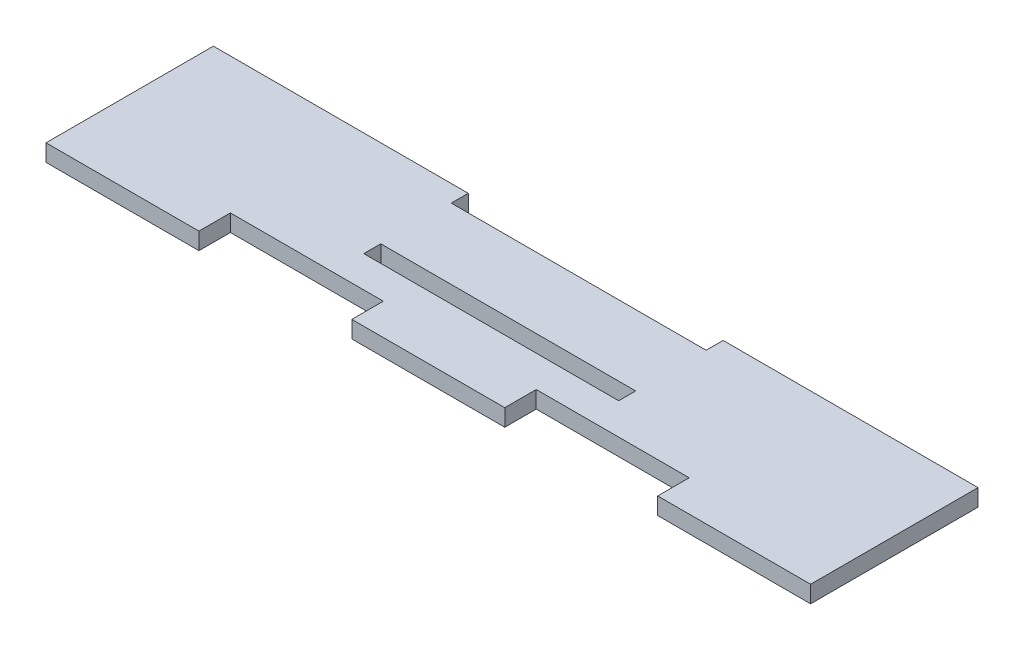
ISO-10303-21;
HEADER;
FILE_DESCRIPTION(('STEP AP214'),'2;1');
FILE_NAME('part.step','',(''),(''),'','','');
FILE_SCHEMA(('AUTOMOTIVE_DESIGN { 1 0 10303 214 1 1 1 1 }'));
ENDSEC;
DATA;
#1=APPLICATION_CONTEXT('core data for automotive mechanical design processes');
#2=APPLICATION_PROTOCOL_DEFINITION('international standard','automotive_design',2000,#1);
#3=PRODUCT_CONTEXT('',#1,'mechanical');
#4=PRODUCT('Part','Part','',(#3));
#5=PRODUCT_RELATED_PRODUCT_CATEGORY('part','',(#4));
#6=PRODUCT_DEFINITION_FORMATION('','',#4);
#7=PRODUCT_DEFINITION_CONTEXT('part definition',#1,'design');
#8=PRODUCT_DEFINITION('design','',#6,#7);
#9=PRODUCT_DEFINITION_SHAPE('','',#8);
#10=(LENGTH_UNIT() NAMED_UNIT(*) SI_UNIT(.MILLI.,.METRE.));
#11=(NAMED_UNIT(*) PLANE_ANGLE_UNIT() SI_UNIT($,.RADIAN.));
#12=(NAMED_UNIT(*) SI_UNIT($,.STERADIAN.) SOLID_ANGLE_UNIT());
#13=UNCERTAINTY_MEASURE_WITH_UNIT(LENGTH_MEASURE(1.E-05),#10,'distance_accuracy_value','');
#14=(GEOMETRIC_REPRESENTATION_CONTEXT(3) GLOBAL_UNCERTAINTY_ASSIGNED_CONTEXT((#13)) GLOBAL_UNIT_ASSIGNED_CONTEXT((#10,
#11,#12)) REPRESENTATION_CONTEXT('',''));
#15=CARTESIAN_POINT('',(0.,0.,0.));
#16=DIRECTION('',(0.,0.,1.));
#17=DIRECTION('',(1.,0.,0.));
#18=AXIS2_PLACEMENT_3D('',#15,#16,#17);
#19=CARTESIAN_POINT('',(0.,2.7,0.));
#20=DIRECTION('',(0.,-1.,0.));
#21=DIRECTION('',(0.,0.,-1.));
#22=AXIS2_PLACEMENT_3D('',#19,#20,#21);
#23=PLANE('',#22);
#24=DIRECTION('',(1.,0.,0.));
#25=VECTOR('',#24,1.);
#26=CARTESIAN_POINT('',(36.45,2.7,13.3));
#27=LINE('',#26,#25);
#28=CARTESIAN_POINT('',(36.45,2.7,13.3));
#29=VERTEX_POINT('',#28);
#30=CARTESIAN_POINT('',(60.75,2.7,13.3));
#31=VERTEX_POINT('',#30);
#32=EDGE_CURVE('E206',#29,#31,#27,.T.);
#33=ORIENTED_EDGE('',*,*,#32,.T.);
#34=DIRECTION('',(0.,0.,-1.));
#35=VECTOR('',#34,1.);
#36=CARTESIAN_POINT('',(60.75,2.7,-13.3));
#37=LINE('',#36,#35);
#38=CARTESIAN_POINT('',(60.75,2.7,-13.3));
#39=VERTEX_POINT('',#38);
#40=EDGE_CURVE('E209',#31,#39,#37,.T.);
#41=ORIENTED_EDGE('',*,*,#40,.T.);
#42=DIRECTION('',(-1.,0.,0.));
#43=VECTOR('',#42,1.);
#44=CARTESIAN_POINT('',(20.25,2.7,-13.3));
#45=LINE('',#44,#43);
#46=CARTESIAN_POINT('',(20.25,2.7,-13.3));
#47=VERTEX_POINT('',#46);
#48=EDGE_CURVE('E212',#39,#47,#45,.T.);
#49=ORIENTED_EDGE('',*,*,#48,.T.);
#50=DIRECTION('',(0.,0.,1.));
#51=VECTOR('',#50,1.);
#52=CARTESIAN_POINT('',(20.25,2.7,-13.3));
#53=LINE('',#52,#51);
#54=CARTESIAN_POINT('',(20.25,2.7,-10.6));
#55=VERTEX_POINT('',#54);
#56=EDGE_CURVE('E214',#47,#55,#53,.T.);
#57=ORIENTED_EDGE('',*,*,#56,.T.);
#58=DIRECTION('',(-1.,0.,0.));
#59=VECTOR('',#58,1.);
#60=CARTESIAN_POINT('',(-20.25,2.7,-10.6));
#61=LINE('',#60,#59);
#62=CARTESIAN_POINT('',(-20.25,2.7,-10.6));
#63=VERTEX_POINT('',#62);
#64=EDGE_CURVE('E216',#55,#63,#61,.T.);
#65=ORIENTED_EDGE('',*,*,#64,.T.);
#66=DIRECTION('',(0.,0.,-1.));
#67=VECTOR('',#66,1.);
#68=CARTESIAN_POINT('',(-20.25,2.7,-13.3));
#69=LINE('',#68,#67);
#70=CARTESIAN_POINT('',(-20.25,2.7,-13.3));
#71=VERTEX_POINT('',#70);
#72=EDGE_CURVE('E218',#63,#71,#69,.T.);
#73=ORIENTED_EDGE('',*,*,#72,.T.);
#74=DIRECTION('',(-1.,0.,0.));
#75=VECTOR('',#74,1.);
#76=CARTESIAN_POINT('',(-60.75,2.7,-13.3));
#77=LINE('',#76,#75);
#78=CARTESIAN_POINT('',(-60.75,2.7,-13.3));
#79=VERTEX_POINT('',#78);
#80=EDGE_CURVE('E220',#71,#79,#77,.T.);
#81=ORIENTED_EDGE('',*,*,#80,.T.);
#82=DIRECTION('',(0.,0.,1.));
#83=VECTOR('',#82,1.);
#84=CARTESIAN_POINT('',(-60.75,2.7,-13.3));
#85=LINE('',#84,#83);
#86=CARTESIAN_POINT('',(-60.75,2.7,13.3));
#87=VERTEX_POINT('',#86);
#88=EDGE_CURVE('E222',#79,#87,#85,.T.);
#89=ORIENTED_EDGE('',*,*,#88,.T.);
#90=DIRECTION('',(1.,0.,0.));
#91=VECTOR('',#90,1.);
#92=CARTESIAN_POINT('',(-60.75,2.7,13.3));
#93=LINE('',#92,#91);
#94=CARTESIAN_POINT('',(-36.45,2.7,13.3));
#95=VERTEX_POINT('',#94);
#96=EDGE_CURVE('E224',#87,#95,#93,.T.);
#97=ORIENTED_EDGE('',*,*,#96,.T.);
#98=DIRECTION('',(0.,0.,-1.));
#99=VECTOR('',#98,1.);
#100=CARTESIAN_POINT('',(-36.45,2.7,13.3));
#101=LINE('',#100,#99);
#102=CARTESIAN_POINT('',(-36.45,2.7,8.3));
#103=VERTEX_POINT('',#102);
#104=EDGE_CURVE('E226',#95,#103,#101,.T.);
#105=ORIENTED_EDGE('',*,*,#104,.T.);
#106=DIRECTION('',(1.,0.,0.));
#107=VECTOR('',#106,1.);
#108=CARTESIAN_POINT('',(-36.45,2.7,8.3));
#109=LINE('',#108,#107);
#110=CARTESIAN_POINT('',(-12.15,2.7,8.3));
#111=VERTEX_POINT('',#110);
#112=EDGE_CURVE('E228',#103,#111,#109,.T.);
#113=ORIENTED_EDGE('',*,*,#112,.T.);
#114=DIRECTION('',(0.,0.,1.));
#115=VECTOR('',#114,1.);
#116=CARTESIAN_POINT('',(-12.15,2.7,13.3));
#117=LINE('',#116,#115);
#118=CARTESIAN_POINT('',(-12.15,2.7,13.3));
#119=VERTEX_POINT('',#118);
#120=EDGE_CURVE('E230',#111,#119,#117,.T.);
#121=ORIENTED_EDGE('',*,*,#120,.T.);
#122=DIRECTION('',(1.,0.,0.));
#123=VECTOR('',#122,1.);
#124=CARTESIAN_POINT('',(-12.15,2.7,13.3));
#125=LINE('',#124,#123);
#126=CARTESIAN_POINT('',(12.15,2.7,13.3));
#127=VERTEX_POINT('',#126);
#128=EDGE_CURVE('E232',#119,#127,#125,.T.);
#129=ORIENTED_EDGE('',*,*,#128,.T.);
#130=DIRECTION('',(0.,0.,-1.));
#131=VECTOR('',#130,1.);
#132=CARTESIAN_POINT('',(12.15,2.7,13.3));
#133=LINE('',#132,#131);
#134=CARTESIAN_POINT('',(12.15,2.7,8.3));
#135=VERTEX_POINT('',#134);
#136=EDGE_CURVE('E234',#127,#135,#133,.T.);
#137=ORIENTED_EDGE('',*,*,#136,.T.);
#138=DIRECTION('',(1.,0.,0.));
#139=VECTOR('',#138,1.);
#140=CARTESIAN_POINT('',(12.15,2.7,8.3));
#141=LINE('',#140,#139);
#142=CARTESIAN_POINT('',(36.45,2.7,8.3));
#143=VERTEX_POINT('',#142);
#144=EDGE_CURVE('E236',#135,#143,#141,.T.);
#145=ORIENTED_EDGE('',*,*,#144,.T.);
#146=DIRECTION('',(0.,0.,1.));
#147=VECTOR('',#146,1.);
#148=CARTESIAN_POINT('',(36.45,2.7,13.3));
#149=LINE('',#148,#147);
#150=EDGE_CURVE('E238',#143,#29,#149,.T.);
#151=ORIENTED_EDGE('',*,*,#150,.T.);
#152=EDGE_LOOP('',(#33,#41,#49,#57,#65,#73,#81,#89,#97,#105,#113,#121,#129,#137,#145,#151));
#153=FACE_BOUND('',#152,.T.);
#154=DIRECTION('',(0.,0.,1.));
#155=VECTOR('',#154,1.);
#156=CARTESIAN_POINT('',(-20.25,2.7,0.600000000000001));
#157=LINE('',#156,#155);
#158=CARTESIAN_POINT('',(-20.25,2.7,0.600000000000001));
#159=VERTEX_POINT('',#158);
#160=CARTESIAN_POINT('',(-20.25,2.7,3.3));
#161=VERTEX_POINT('',#160);
#162=EDGE_CURVE('E170',#159,#161,#157,.T.);
#163=ORIENTED_EDGE('',*,*,#162,.F.);
#164=DIRECTION('',(-1.,0.,0.));
#165=VECTOR('',#164,1.);
#166=CARTESIAN_POINT('',(-20.25,2.7,0.600000000000001));
#167=LINE('',#166,#165);
#168=CARTESIAN_POINT('',(20.25,2.7,0.600000000000001));
#169=VERTEX_POINT('',#168);
#170=EDGE_CURVE('E192',#169,#159,#167,.T.);
#171=ORIENTED_EDGE('',*,*,#170,.F.);
#172=DIRECTION('',(0.,0.,-1.));
#173=VECTOR('',#172,1.);
#174=CARTESIAN_POINT('',(20.25,2.7,0.600000000000001));
#175=LINE('',#174,#173);
#176=CARTESIAN_POINT('',(20.25,2.7,3.3));
#177=VERTEX_POINT('',#176);
#178=EDGE_CURVE('E190',#177,#169,#175,.T.);
#179=ORIENTED_EDGE('',*,*,#178,.F.);
#180=DIRECTION('',(1.,0.,0.));
#181=VECTOR('',#180,1.);
#182=CARTESIAN_POINT('',(-20.25,2.7,3.3));
#183=LINE('',#182,#181);
#184=EDGE_CURVE('E178',#161,#177,#183,.T.);
#185=ORIENTED_EDGE('',*,*,#184,.F.);
#186=EDGE_LOOP('',(#163,#171,#179,#185));
#187=FACE_BOUND('',#186,.T.);
#188=ADVANCED_FACE('F33',(#153,#187),#23,.F.);
#189=CARTESIAN_POINT('',(0.,0.,0.));
#190=DIRECTION('',(0.,-1.,0.));
#191=DIRECTION('',(0.,0.,-1.));
#192=AXIS2_PLACEMENT_3D('',#189,#190,#191);
#193=PLANE('',#192);
#194=DIRECTION('',(1.,0.,0.));
#195=VECTOR('',#194,1.);
#196=CARTESIAN_POINT('',(36.45,0.,13.3));
#197=LINE('',#196,#195);
#198=CARTESIAN_POINT('',(36.45,0.,13.3));
#199=VERTEX_POINT('',#198);
#200=CARTESIAN_POINT('',(60.75,0.,13.3));
#201=VERTEX_POINT('',#200);
#202=EDGE_CURVE('E186',#199,#201,#197,.T.);
#203=ORIENTED_EDGE('',*,*,#202,.F.);
#204=DIRECTION('',(0.,0.,1.));
#205=VECTOR('',#204,1.);
#206=CARTESIAN_POINT('',(36.45,0.,13.3));
#207=LINE('',#206,#205);
#208=CARTESIAN_POINT('',(36.45,0.,8.3));
#209=VERTEX_POINT('',#208);
#210=EDGE_CURVE('E210',#209,#199,#207,.T.);
#211=ORIENTED_EDGE('',*,*,#210,.F.);
#212=DIRECTION('',(1.,0.,0.));
#213=VECTOR('',#212,1.);
#214=CARTESIAN_POINT('',(12.15,0.,8.3));
#215=LINE('',#214,#213);
#216=CARTESIAN_POINT('',(12.15,0.,8.3));
#217=VERTEX_POINT('',#216);
#218=EDGE_CURVE('E269',#217,#209,#215,.T.);
#219=ORIENTED_EDGE('',*,*,#218,.F.);
#220=DIRECTION('',(0.,0.,-1.));
#221=VECTOR('',#220,1.);
#222=CARTESIAN_POINT('',(12.15,0.,13.3));
#223=LINE('',#222,#221);
#224=CARTESIAN_POINT('',(12.15,0.,13.3));
#225=VERTEX_POINT('',#224);
#226=EDGE_CURVE('E267',#225,#217,#223,.T.);
#227=ORIENTED_EDGE('',*,*,#226,.F.);
#228=DIRECTION('',(1.,0.,0.));
#229=VECTOR('',#228,1.);
#230=CARTESIAN_POINT('',(-12.15,0.,13.3));
#231=LINE('',#230,#229);
#232=CARTESIAN_POINT('',(-12.15,0.,13.3));
#233=VERTEX_POINT('',#232);
#234=EDGE_CURVE('E265',#233,#225,#231,.T.);
#235=ORIENTED_EDGE('',*,*,#234,.F.);
#236=DIRECTION('',(0.,0.,1.));
#237=VECTOR('',#236,1.);
#238=CARTESIAN_POINT('',(-12.15,0.,13.3));
#239=LINE('',#238,#237);
#240=CARTESIAN_POINT('',(-12.15,0.,8.3));
#241=VERTEX_POINT('',#240);
#242=EDGE_CURVE('E263',#241,#233,#239,.T.);
#243=ORIENTED_EDGE('',*,*,#242,.F.);
#244=DIRECTION('',(1.,0.,0.));
#245=VECTOR('',#244,1.);
#246=CARTESIAN_POINT('',(-36.45,0.,8.3));
#247=LINE('',#246,#245);
#248=CARTESIAN_POINT('',(-36.45,0.,8.3));
#249=VERTEX_POINT('',#248);
#250=EDGE_CURVE('E261',#249,#241,#247,.T.);
#251=ORIENTED_EDGE('',*,*,#250,.F.);
#252=DIRECTION('',(0.,0.,-1.));
#253=VECTOR('',#252,1.);
#254=CARTESIAN_POINT('',(-36.45,0.,13.3));
#255=LINE('',#254,#253);
#256=CARTESIAN_POINT('',(-36.45,0.,13.3));
#257=VERTEX_POINT('',#256);
#258=EDGE_CURVE('E259',#257,#249,#255,.T.);
#259=ORIENTED_EDGE('',*,*,#258,.F.);
#260=DIRECTION('',(1.,0.,0.));
#261=VECTOR('',#260,1.);
#262=CARTESIAN_POINT('',(-60.75,0.,13.3));
#263=LINE('',#262,#261);
#264=CARTESIAN_POINT('',(-60.75,0.,13.3));
#265=VERTEX_POINT('',#264);
#266=EDGE_CURVE('E257',#265,#257,#263,.T.);
#267=ORIENTED_EDGE('',*,*,#266,.F.);
#268=DIRECTION('',(0.,0.,1.));
#269=VECTOR('',#268,1.);
#270=CARTESIAN_POINT('',(-60.75,0.,-13.3));
#271=LINE('',#270,#269);
#272=CARTESIAN_POINT('',(-60.75,0.,-13.3));
#273=VERTEX_POINT('',#272);
#274=EDGE_CURVE('E255',#273,#265,#271,.T.);
#275=ORIENTED_EDGE('',*,*,#274,.F.);
#276=DIRECTION('',(-1.,0.,0.));
#277=VECTOR('',#276,1.);
#278=CARTESIAN_POINT('',(-60.75,0.,-13.3));
#279=LINE('',#278,#277);
#280=CARTESIAN_POINT('',(-20.25,0.,-13.3));
#281=VERTEX_POINT('',#280);
#282=EDGE_CURVE('E253',#281,#273,#279,.T.);
#283=ORIENTED_EDGE('',*,*,#282,.F.);
#284=DIRECTION('',(0.,0.,-1.));
#285=VECTOR('',#284,1.);
#286=CARTESIAN_POINT('',(-20.25,0.,-13.3));
#287=LINE('',#286,#285);
#288=CARTESIAN_POINT('',(-20.25,0.,-10.6));
#289=VERTEX_POINT('',#288);
#290=EDGE_CURVE('E251',#289,#281,#287,.T.);
#291=ORIENTED_EDGE('',*,*,#290,.F.);
#292=DIRECTION('',(-1.,0.,0.));
#293=VECTOR('',#292,1.);
#294=CARTESIAN_POINT('',(-20.25,0.,-10.6));
#295=LINE('',#294,#293);
#296=CARTESIAN_POINT('',(20.25,0.,-10.6));
#297=VERTEX_POINT('',#296);
#298=EDGE_CURVE('E249',#297,#289,#295,.T.);
#299=ORIENTED_EDGE('',*,*,#298,.F.);
#300=DIRECTION('',(0.,0.,1.));
#301=VECTOR('',#300,1.);
#302=CARTESIAN_POINT('',(20.25,0.,-13.3));
#303=LINE('',#302,#301);
#304=CARTESIAN_POINT('',(20.25,0.,-13.3));
#305=VERTEX_POINT('',#304);
#306=EDGE_CURVE('E247',#305,#297,#303,.T.);
#307=ORIENTED_EDGE('',*,*,#306,.F.);
#308=DIRECTION('',(-1.,0.,0.));
#309=VECTOR('',#308,1.);
#310=CARTESIAN_POINT('',(20.25,0.,-13.3));
#311=LINE('',#310,#309);
#312=CARTESIAN_POINT('',(60.75,0.,-13.3));
#313=VERTEX_POINT('',#312);
#314=EDGE_CURVE('E245',#313,#305,#311,.T.);
#315=ORIENTED_EDGE('',*,*,#314,.F.);
#316=DIRECTION('',(0.,0.,-1.));
#317=VECTOR('',#316,1.);
#318=CARTESIAN_POINT('',(60.75,0.,-13.3));
#319=LINE('',#318,#317);
#320=EDGE_CURVE('E243',#201,#313,#319,.T.);
#321=ORIENTED_EDGE('',*,*,#320,.F.);
#322=EDGE_LOOP('',(#203,#211,#219,#227,#235,#243,#251,#259,#267,#275,#283,#291,#299,#307,#315,#321));
#323=FACE_BOUND('',#322,.T.);
#324=DIRECTION('',(-1.,0.,0.));
#325=VECTOR('',#324,1.);
#326=CARTESIAN_POINT('',(-20.25,0.,0.600000000000001));
#327=LINE('',#326,#325);
#328=CARTESIAN_POINT('',(20.25,0.,0.600000000000001));
#329=VERTEX_POINT('',#328);
#330=CARTESIAN_POINT('',(-20.25,0.,0.600000000000001));
#331=VERTEX_POINT('',#330);
#332=EDGE_CURVE('E179',#329,#331,#327,.T.);
#333=ORIENTED_EDGE('',*,*,#332,.T.);
#334=DIRECTION('',(0.,0.,1.));
#335=VECTOR('',#334,1.);
#336=CARTESIAN_POINT('',(-20.25,0.,0.600000000000001));
#337=LINE('',#336,#335);
#338=CARTESIAN_POINT('',(-20.25,0.,3.3));
#339=VERTEX_POINT('',#338);
#340=EDGE_CURVE('E56',#331,#339,#337,.T.);
#341=ORIENTED_EDGE('',*,*,#340,.T.);
#342=DIRECTION('',(1.,0.,0.));
#343=VECTOR('',#342,1.);
#344=CARTESIAN_POINT('',(-20.25,0.,3.3));
#345=LINE('',#344,#343);
#346=CARTESIAN_POINT('',(20.25,0.,3.3));
#347=VERTEX_POINT('',#346);
#348=EDGE_CURVE('E185',#339,#347,#345,.T.);
#349=ORIENTED_EDGE('',*,*,#348,.T.);
#350=DIRECTION('',(0.,0.,-1.));
#351=VECTOR('',#350,1.);
#352=CARTESIAN_POINT('',(20.25,0.,0.600000000000001));
#353=LINE('',#352,#351);
#354=EDGE_CURVE('E198',#347,#329,#353,.T.);
#355=ORIENTED_EDGE('',*,*,#354,.T.);
#356=EDGE_LOOP('',(#333,#341,#349,#355));
#357=FACE_BOUND('',#356,.T.);
#358=ADVANCED_FACE('F323',(#323,#357),#193,.T.);
#359=CARTESIAN_POINT('',(36.45,2.7,13.3));
#360=DIRECTION('',(0.,0.,-1.));
#361=DIRECTION('',(-1.,0.,0.));
#362=AXIS2_PLACEMENT_3D('',#359,#360,#361);
#363=PLANE('',#362);
#364=ORIENTED_EDGE('',*,*,#202,.T.);
#365=DIRECTION('',(0.,-1.,0.));
#366=VECTOR('',#365,1.);
#367=CARTESIAN_POINT('',(60.75,2.7,13.3));
#368=LINE('',#367,#366);
#369=EDGE_CURVE('E11',#31,#201,#368,.T.);
#370=ORIENTED_EDGE('',*,*,#369,.F.);
#371=ORIENTED_EDGE('',*,*,#32,.F.);
#372=DIRECTION('',(0.,-1.,0.));
#373=VECTOR('',#372,1.);
#374=CARTESIAN_POINT('',(36.45,2.7,13.3));
#375=LINE('',#374,#373);
#376=EDGE_CURVE('E240',#29,#199,#375,.T.);
#377=ORIENTED_EDGE('',*,*,#376,.T.);
#378=EDGE_LOOP('',(#364,#370,#371,#377));
#379=FACE_BOUND('',#378,.T.);
#380=ADVANCED_FACE('F35',(#379),#363,.F.);
#381=CARTESIAN_POINT('',(60.75,2.7,-13.3));
#382=DIRECTION('',(-1.,0.,0.));
#383=DIRECTION('',(0.,0.,1.));
#384=AXIS2_PLACEMENT_3D('',#381,#382,#383);
#385=PLANE('',#384);
#386=ORIENTED_EDGE('',*,*,#320,.T.);
#387=DIRECTION('',(0.,-1.,0.));
#388=VECTOR('',#387,1.);
#389=CARTESIAN_POINT('',(60.75,2.7,-13.3));
#390=LINE('',#389,#388);
#391=EDGE_CURVE('E41',#39,#313,#390,.T.);
#392=ORIENTED_EDGE('',*,*,#391,.F.);
#393=ORIENTED_EDGE('',*,*,#40,.F.);
#394=ORIENTED_EDGE('',*,*,#369,.T.);
#395=EDGE_LOOP('',(#386,#392,#393,#394));
#396=FACE_BOUND('',#395,.T.);
#397=ADVANCED_FACE('F340',(#396),#385,.F.);
#398=CARTESIAN_POINT('',(20.25,2.7,-13.3));
#399=DIRECTION('',(0.,0.,1.));
#400=DIRECTION('',(1.,0.,0.));
#401=AXIS2_PLACEMENT_3D('',#398,#399,#400);
#402=PLANE('',#401);
#403=ORIENTED_EDGE('',*,*,#314,.T.);
#404=DIRECTION('',(0.,-1.,0.));
#405=VECTOR('',#404,1.);
#406=CARTESIAN_POINT('',(20.25,2.7,-13.3));
#407=LINE('',#406,#405);
#408=EDGE_CURVE('E310',#47,#305,#407,.T.);
#409=ORIENTED_EDGE('',*,*,#408,.F.);
#410=ORIENTED_EDGE('',*,*,#48,.F.);
#411=ORIENTED_EDGE('',*,*,#391,.T.);
#412=EDGE_LOOP('',(#403,#409,#410,#411));
#413=FACE_BOUND('',#412,.T.);
#414=ADVANCED_FACE('F317',(#413),#402,.F.);
#415=CARTESIAN_POINT('',(20.25,2.7,-13.3));
#416=DIRECTION('',(1.,0.,0.));
#417=DIRECTION('',(0.,0.,-1.));
#418=AXIS2_PLACEMENT_3D('',#415,#416,#417);
#419=PLANE('',#418);
#420=ORIENTED_EDGE('',*,*,#306,.T.);
#421=DIRECTION('',(0.,-1.,0.));
#422=VECTOR('',#421,1.);
#423=CARTESIAN_POINT('',(20.25,2.7,-10.6));
#424=LINE('',#423,#422);
#425=EDGE_CURVE('E307',#55,#297,#424,.T.);
#426=ORIENTED_EDGE('',*,*,#425,.F.);
#427=ORIENTED_EDGE('',*,*,#56,.F.);
#428=ORIENTED_EDGE('',*,*,#408,.T.);
#429=EDGE_LOOP('',(#420,#426,#427,#428));
#430=FACE_BOUND('',#429,.T.);
#431=ADVANCED_FACE('F329',(#430),#419,.F.);
#432=CARTESIAN_POINT('',(-20.25,2.7,-10.6));
#433=DIRECTION('',(0.,0.,1.));
#434=DIRECTION('',(1.,0.,0.));
#435=AXIS2_PLACEMENT_3D('',#432,#433,#434);
#436=PLANE('',#435);
#437=ORIENTED_EDGE('',*,*,#298,.T.);
#438=DIRECTION('',(0.,-1.,0.));
#439=VECTOR('',#438,1.);
#440=CARTESIAN_POINT('',(-20.25,2.7,-10.6));
#441=LINE('',#440,#439);
#442=EDGE_CURVE('E304',#63,#289,#441,.T.);
#443=ORIENTED_EDGE('',*,*,#442,.F.);
#444=ORIENTED_EDGE('',*,*,#64,.F.);
#445=ORIENTED_EDGE('',*,*,#425,.T.);
#446=EDGE_LOOP('',(#437,#443,#444,#445));
#447=FACE_BOUND('',#446,.T.);
#448=ADVANCED_FACE('F333',(#447),#436,.F.);
#449=CARTESIAN_POINT('',(-20.25,2.7,-13.3));
#450=DIRECTION('',(-1.,0.,0.));
#451=DIRECTION('',(0.,0.,1.));
#452=AXIS2_PLACEMENT_3D('',#449,#450,#451);
#453=PLANE('',#452);
#454=ORIENTED_EDGE('',*,*,#290,.T.);
#455=DIRECTION('',(0.,-1.,0.));
#456=VECTOR('',#455,1.);
#457=CARTESIAN_POINT('',(-20.25,2.7,-13.3));
#458=LINE('',#457,#456);
#459=EDGE_CURVE('E301',#71,#281,#458,.T.);
#460=ORIENTED_EDGE('',*,*,#459,.F.);
#461=ORIENTED_EDGE('',*,*,#72,.F.);
#462=ORIENTED_EDGE('',*,*,#442,.T.);
#463=EDGE_LOOP('',(#454,#460,#461,#462));
#464=FACE_BOUND('',#463,.T.);
#465=ADVANCED_FACE('F393',(#464),#453,.F.);
#466=CARTESIAN_POINT('',(-60.75,2.7,-13.3));
#467=DIRECTION('',(0.,0.,1.));
#468=DIRECTION('',(1.,0.,0.));
#469=AXIS2_PLACEMENT_3D('',#466,#467,#468);
#470=PLANE('',#469);
#471=ORIENTED_EDGE('',*,*,#282,.T.);
#472=DIRECTION('',(0.,-1.,0.));
#473=VECTOR('',#472,1.);
#474=CARTESIAN_POINT('',(-60.75,2.7,-13.3));
#475=LINE('',#474,#473);
#476=EDGE_CURVE('E298',#79,#273,#475,.T.);
#477=ORIENTED_EDGE('',*,*,#476,.F.);
#478=ORIENTED_EDGE('',*,*,#80,.F.);
#479=ORIENTED_EDGE('',*,*,#459,.T.);
#480=EDGE_LOOP('',(#471,#477,#478,#479));
#481=FACE_BOUND('',#480,.T.);
#482=ADVANCED_FACE('F390',(#481),#470,.F.);
#483=CARTESIAN_POINT('',(-60.75,2.7,-13.3));
#484=DIRECTION('',(1.,0.,0.));
#485=DIRECTION('',(0.,0.,-1.));
#486=AXIS2_PLACEMENT_3D('',#483,#484,#485);
#487=PLANE('',#486);
#488=ORIENTED_EDGE('',*,*,#274,.T.);
#489=DIRECTION('',(0.,-1.,0.));
#490=VECTOR('',#489,1.);
#491=CARTESIAN_POINT('',(-60.75,2.7,13.3));
#492=LINE('',#491,#490);
#493=EDGE_CURVE('E295',#87,#265,#492,.T.);
#494=ORIENTED_EDGE('',*,*,#493,.F.);
#495=ORIENTED_EDGE('',*,*,#88,.F.);
#496=ORIENTED_EDGE('',*,*,#476,.T.);
#497=EDGE_LOOP('',(#488,#494,#495,#496));
#498=FACE_BOUND('',#497,.T.);
#499=ADVANCED_FACE('F386',(#498),#487,.F.);
#500=CARTESIAN_POINT('',(-60.75,2.7,13.3));
#501=DIRECTION('',(0.,0.,-1.));
#502=DIRECTION('',(-1.,0.,0.));
#503=AXIS2_PLACEMENT_3D('',#500,#501,#502);
#504=PLANE('',#503);
#505=ORIENTED_EDGE('',*,*,#266,.T.);
#506=DIRECTION('',(0.,-1.,0.));
#507=VECTOR('',#506,1.);
#508=CARTESIAN_POINT('',(-36.45,2.7,13.3));
#509=LINE('',#508,#507);
#510=EDGE_CURVE('E292',#95,#257,#509,.T.);
#511=ORIENTED_EDGE('',*,*,#510,.F.);
#512=ORIENTED_EDGE('',*,*,#96,.F.);
#513=ORIENTED_EDGE('',*,*,#493,.T.);
#514=EDGE_LOOP('',(#505,#511,#512,#513));
#515=FACE_BOUND('',#514,.T.);
#516=ADVANCED_FACE('F382',(#515),#504,.F.);
#517=CARTESIAN_POINT('',(-36.45,2.7,13.3));
#518=DIRECTION('',(-1.,0.,0.));
#519=DIRECTION('',(0.,0.,1.));
#520=AXIS2_PLACEMENT_3D('',#517,#518,#519);
#521=PLANE('',#520);
#522=ORIENTED_EDGE('',*,*,#258,.T.);
#523=DIRECTION('',(0.,-1.,0.));
#524=VECTOR('',#523,1.);
#525=CARTESIAN_POINT('',(-36.45,2.7,8.3));
#526=LINE('',#525,#524);
#527=EDGE_CURVE('E289',#103,#249,#526,.T.);
#528=ORIENTED_EDGE('',*,*,#527,.F.);
#529=ORIENTED_EDGE('',*,*,#104,.F.);
#530=ORIENTED_EDGE('',*,*,#510,.T.);
#531=EDGE_LOOP('',(#522,#528,#529,#530));
#532=FACE_BOUND('',#531,.T.);
#533=ADVANCED_FACE('F377',(#532),#521,.F.);
#534=CARTESIAN_POINT('',(-36.45,2.7,8.3));
#535=DIRECTION('',(0.,0.,-1.));
#536=DIRECTION('',(-1.,0.,0.));
#537=AXIS2_PLACEMENT_3D('',#534,#535,#536);
#538=PLANE('',#537);
#539=ORIENTED_EDGE('',*,*,#250,.T.);
#540=DIRECTION('',(0.,-1.,0.));
#541=VECTOR('',#540,1.);
#542=CARTESIAN_POINT('',(-12.15,2.7,8.3));
#543=LINE('',#542,#541);
#544=EDGE_CURVE('E286',#111,#241,#543,.T.);
#545=ORIENTED_EDGE('',*,*,#544,.F.);
#546=ORIENTED_EDGE('',*,*,#112,.F.);
#547=ORIENTED_EDGE('',*,*,#527,.T.);
#548=EDGE_LOOP('',(#539,#545,#546,#547));
#549=FACE_BOUND('',#548,.T.);
#550=ADVANCED_FACE('F371',(#549),#538,.F.);
#551=CARTESIAN_POINT('',(-12.15,2.7,13.3));
#552=DIRECTION('',(1.,0.,0.));
#553=DIRECTION('',(0.,0.,-1.));
#554=AXIS2_PLACEMENT_3D('',#551,#552,#553);
#555=PLANE('',#554);
#556=ORIENTED_EDGE('',*,*,#242,.T.);
#557=DIRECTION('',(0.,-1.,0.));
#558=VECTOR('',#557,1.);
#559=CARTESIAN_POINT('',(-12.15,2.7,13.3));
#560=LINE('',#559,#558);
#561=EDGE_CURVE('E283',#119,#233,#560,.T.);
#562=ORIENTED_EDGE('',*,*,#561,.F.);
#563=ORIENTED_EDGE('',*,*,#120,.F.);
#564=ORIENTED_EDGE('',*,*,#544,.T.);
#565=EDGE_LOOP('',(#556,#562,#563,#564));
#566=FACE_BOUND('',#565,.T.);
#567=ADVANCED_FACE('F367',(#566),#555,.F.);
#568=CARTESIAN_POINT('',(-12.15,2.7,13.3));
#569=DIRECTION('',(0.,0.,-1.));
#570=DIRECTION('',(-1.,0.,0.));
#571=AXIS2_PLACEMENT_3D('',#568,#569,#570);
#572=PLANE('',#571);
#573=ORIENTED_EDGE('',*,*,#234,.T.);
#574=DIRECTION('',(0.,-1.,0.));
#575=VECTOR('',#574,1.);
#576=CARTESIAN_POINT('',(12.15,2.7,13.3));
#577=LINE('',#576,#575);
#578=EDGE_CURVE('E280',#127,#225,#577,.T.);
#579=ORIENTED_EDGE('',*,*,#578,.F.);
#580=ORIENTED_EDGE('',*,*,#128,.F.);
#581=ORIENTED_EDGE('',*,*,#561,.T.);
#582=EDGE_LOOP('',(#573,#579,#580,#581));
#583=FACE_BOUND('',#582,.T.);
#584=ADVANCED_FACE('F362',(#583),#572,.F.);
#585=CARTESIAN_POINT('',(12.15,2.7,13.3));
#586=DIRECTION('',(-1.,0.,0.));
#587=DIRECTION('',(0.,0.,1.));
#588=AXIS2_PLACEMENT_3D('',#585,#586,#587);
#589=PLANE('',#588);
#590=ORIENTED_EDGE('',*,*,#226,.T.);
#591=DIRECTION('',(0.,-1.,0.));
#592=VECTOR('',#591,1.);
#593=CARTESIAN_POINT('',(12.15,2.7,8.3));
#594=LINE('',#593,#592);
#595=EDGE_CURVE('E277',#135,#217,#594,.T.);
#596=ORIENTED_EDGE('',*,*,#595,.F.);
#597=ORIENTED_EDGE('',*,*,#136,.F.);
#598=ORIENTED_EDGE('',*,*,#578,.T.);
#599=EDGE_LOOP('',(#590,#596,#597,#598));
#600=FACE_BOUND('',#599,.T.);
#601=ADVANCED_FACE('F356',(#600),#589,.F.);
#602=CARTESIAN_POINT('',(12.15,2.7,8.3));
#603=DIRECTION('',(0.,0.,-1.));
#604=DIRECTION('',(-1.,0.,0.));
#605=AXIS2_PLACEMENT_3D('',#602,#603,#604);
#606=PLANE('',#605);
#607=ORIENTED_EDGE('',*,*,#218,.T.);
#608=DIRECTION('',(0.,-1.,0.));
#609=VECTOR('',#608,1.);
#610=CARTESIAN_POINT('',(36.45,2.7,8.3));
#611=LINE('',#610,#609);
#612=EDGE_CURVE('E274',#143,#209,#611,.T.);
#613=ORIENTED_EDGE('',*,*,#612,.F.);
#614=ORIENTED_EDGE('',*,*,#144,.F.);
#615=ORIENTED_EDGE('',*,*,#595,.T.);
#616=EDGE_LOOP('',(#607,#613,#614,#615));
#617=FACE_BOUND('',#616,.T.);
#618=ADVANCED_FACE('F352',(#617),#606,.F.);
#619=CARTESIAN_POINT('',(36.45,2.7,13.3));
#620=DIRECTION('',(1.,0.,0.));
#621=DIRECTION('',(0.,0.,-1.));
#622=AXIS2_PLACEMENT_3D('',#619,#620,#621);
#623=PLANE('',#622);
#624=ORIENTED_EDGE('',*,*,#210,.T.);
#625=ORIENTED_EDGE('',*,*,#376,.F.);
#626=ORIENTED_EDGE('',*,*,#150,.F.);
#627=ORIENTED_EDGE('',*,*,#612,.T.);
#628=EDGE_LOOP('',(#624,#625,#626,#627));
#629=FACE_BOUND('',#628,.T.);
#630=ADVANCED_FACE('F347',(#629),#623,.F.);
#631=CARTESIAN_POINT('',(-20.25,2.7,0.600000000000001));
#632=DIRECTION('',(1.,0.,0.));
#633=DIRECTION('',(0.,0.,-1.));
#634=AXIS2_PLACEMENT_3D('',#631,#632,#633);
#635=PLANE('',#634);
#636=ORIENTED_EDGE('',*,*,#340,.F.);
#637=DIRECTION('',(0.,-1.,0.));
#638=VECTOR('',#637,1.);
#639=CARTESIAN_POINT('',(-20.25,2.7,0.600000000000001));
#640=LINE('',#639,#638);
#641=EDGE_CURVE('E174',#159,#331,#640,.T.);
#642=ORIENTED_EDGE('',*,*,#641,.F.);
#643=ORIENTED_EDGE('',*,*,#162,.T.);
#644=DIRECTION('',(0.,-1.,0.));
#645=VECTOR('',#644,1.);
#646=CARTESIAN_POINT('',(-20.25,2.7,3.3));
#647=LINE('',#646,#645);
#648=EDGE_CURVE('E173',#161,#339,#647,.T.);
#649=ORIENTED_EDGE('',*,*,#648,.T.);
#650=EDGE_LOOP('',(#636,#642,#643,#649));
#651=FACE_BOUND('',#650,.T.);
#652=ADVANCED_FACE('F172',(#651),#635,.T.);
#653=CARTESIAN_POINT('',(-20.25,2.7,3.3));
#654=DIRECTION('',(0.,0.,-1.));
#655=DIRECTION('',(-1.,0.,0.));
#656=AXIS2_PLACEMENT_3D('',#653,#654,#655);
#657=PLANE('',#656);
#658=ORIENTED_EDGE('',*,*,#348,.F.);
#659=ORIENTED_EDGE('',*,*,#648,.F.);
#660=ORIENTED_EDGE('',*,*,#184,.T.);
#661=DIRECTION('',(0.,-1.,0.));
#662=VECTOR('',#661,1.);
#663=CARTESIAN_POINT('',(20.25,2.7,3.3));
#664=LINE('',#663,#662);
#665=EDGE_CURVE('E187',#177,#347,#664,.T.);
#666=ORIENTED_EDGE('',*,*,#665,.T.);
#667=EDGE_LOOP('',(#658,#659,#660,#666));
#668=FACE_BOUND('',#667,.T.);
#669=ADVANCED_FACE('F182',(#668),#657,.T.);
#670=CARTESIAN_POINT('',(20.25,2.7,0.600000000000001));
#671=DIRECTION('',(-1.,0.,0.));
#672=DIRECTION('',(0.,0.,1.));
#673=AXIS2_PLACEMENT_3D('',#670,#671,#672);
#674=PLANE('',#673);
#675=ORIENTED_EDGE('',*,*,#354,.F.);
#676=ORIENTED_EDGE('',*,*,#665,.F.);
#677=ORIENTED_EDGE('',*,*,#178,.T.);
#678=DIRECTION('',(0.,-1.,0.));
#679=VECTOR('',#678,1.);
#680=CARTESIAN_POINT('',(20.25,2.7,0.600000000000001));
#681=LINE('',#680,#679);
#682=EDGE_CURVE('E48',#169,#329,#681,.T.);
#683=ORIENTED_EDGE('',*,*,#682,.T.);
#684=EDGE_LOOP('',(#675,#676,#677,#683));
#685=FACE_BOUND('',#684,.T.);
#686=ADVANCED_FACE('F475',(#685),#674,.T.);
#687=CARTESIAN_POINT('',(-20.25,2.7,0.600000000000001));
#688=DIRECTION('',(0.,0.,1.));
#689=DIRECTION('',(1.,0.,0.));
#690=AXIS2_PLACEMENT_3D('',#687,#688,#689);
#691=PLANE('',#690);
#692=ORIENTED_EDGE('',*,*,#332,.F.);
#693=ORIENTED_EDGE('',*,*,#682,.F.);
#694=ORIENTED_EDGE('',*,*,#170,.T.);
#695=ORIENTED_EDGE('',*,*,#641,.T.);
#696=EDGE_LOOP('',(#692,#693,#694,#695));
#697=FACE_BOUND('',#696,.T.);
#698=ADVANCED_FACE('F481',(#697),#691,.T.);
#699=CLOSED_SHELL('',(#188,#358,#380,#397,#414,#431,#448,#465,#482,#499,#516,#533,#550,#567,
#584,#601,#618,#630,#652,#669,#686,#698));
#700=MANIFOLD_SOLID_BREP('B2',#699);
#701=ADVANCED_BREP_SHAPE_REPRESENTATION('',(#18,#700),#14);
#702=SHAPE_DEFINITION_REPRESENTATION(#9,#701);
ENDSEC;
END-ISO-10303-21;
